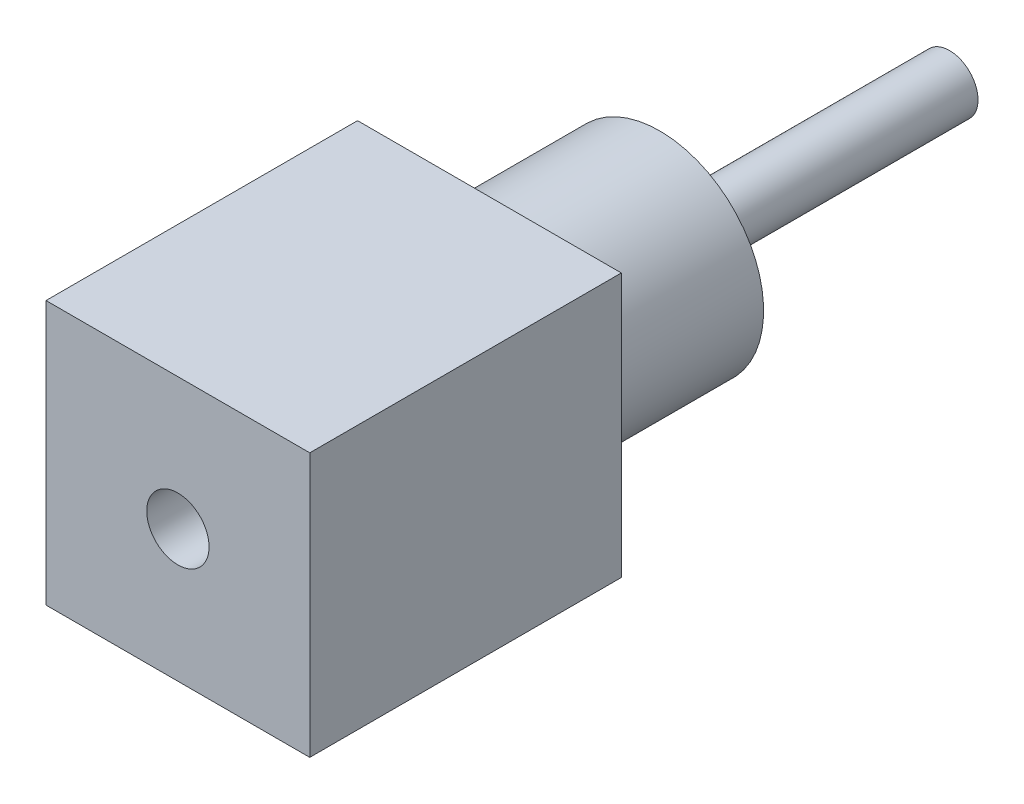
ISO-10303-21;
HEADER;
FILE_DESCRIPTION(('STEP AP214'),'2;1');
FILE_NAME('part.step','',(''),(''),'','','');
FILE_SCHEMA(('AUTOMOTIVE_DESIGN { 1 0 10303 214 1 1 1 1 }'));
ENDSEC;
DATA;
#1=APPLICATION_CONTEXT('core data for automotive mechanical design processes');
#2=APPLICATION_PROTOCOL_DEFINITION('international standard','automotive_design',2000,#1);
#3=PRODUCT_CONTEXT('',#1,'mechanical');
#4=PRODUCT('Part','Part','',(#3));
#5=PRODUCT_RELATED_PRODUCT_CATEGORY('part','',(#4));
#6=PRODUCT_DEFINITION_FORMATION('','',#4);
#7=PRODUCT_DEFINITION_CONTEXT('part definition',#1,'design');
#8=PRODUCT_DEFINITION('design','',#6,#7);
#9=PRODUCT_DEFINITION_SHAPE('','',#8);
#10=(LENGTH_UNIT() NAMED_UNIT(*) SI_UNIT(.MILLI.,.METRE.));
#11=(NAMED_UNIT(*) PLANE_ANGLE_UNIT() SI_UNIT($,.RADIAN.));
#12=(NAMED_UNIT(*) SI_UNIT($,.STERADIAN.) SOLID_ANGLE_UNIT());
#13=UNCERTAINTY_MEASURE_WITH_UNIT(LENGTH_MEASURE(1.E-05),#10,'distance_accuracy_value','');
#14=(GEOMETRIC_REPRESENTATION_CONTEXT(3) GLOBAL_UNCERTAINTY_ASSIGNED_CONTEXT((#13)) GLOBAL_UNIT_ASSIGNED_CONTEXT((#10,
#11,#12)) REPRESENTATION_CONTEXT('',''));
#15=CARTESIAN_POINT('',(0.,0.,0.));
#16=DIRECTION('',(0.,0.,1.));
#17=DIRECTION('',(1.,0.,0.));
#18=AXIS2_PLACEMENT_3D('',#15,#16,#17);
#19=CARTESIAN_POINT('',(-1.27,-1.27,3.));
#20=DIRECTION('',(1.,0.,0.));
#21=DIRECTION('',(0.,0.,-1.));
#22=AXIS2_PLACEMENT_3D('',#19,#20,#21);
#23=PLANE('',#22);
#24=DIRECTION('',(0.,-1.,0.));
#25=VECTOR('',#24,1.);
#26=CARTESIAN_POINT('',(-1.27,-1.27,0.));
#27=LINE('',#26,#25);
#28=CARTESIAN_POINT('',(-1.27,1.27,0.));
#29=VERTEX_POINT('',#28);
#30=CARTESIAN_POINT('',(-1.27,-1.27,0.));
#31=VERTEX_POINT('',#30);
#32=EDGE_CURVE('E100',#29,#31,#27,.T.);
#33=ORIENTED_EDGE('',*,*,#32,.T.);
#34=DIRECTION('',(0.,0.,-1.));
#35=VECTOR('',#34,1.);
#36=CARTESIAN_POINT('',(-1.27,-1.27,3.));
#37=LINE('',#36,#35);
#38=CARTESIAN_POINT('',(-1.27,-1.27,3.));
#39=VERTEX_POINT('',#38);
#40=EDGE_CURVE('E36',#39,#31,#37,.T.);
#41=ORIENTED_EDGE('',*,*,#40,.F.);
#42=DIRECTION('',(0.,-1.,0.));
#43=VECTOR('',#42,1.);
#44=CARTESIAN_POINT('',(-1.27,-1.27,3.));
#45=LINE('',#44,#43);
#46=CARTESIAN_POINT('',(-1.27,1.27,3.));
#47=VERTEX_POINT('',#46);
#48=EDGE_CURVE('E87',#47,#39,#45,.T.);
#49=ORIENTED_EDGE('',*,*,#48,.F.);
#50=DIRECTION('',(0.,0.,-1.));
#51=VECTOR('',#50,1.);
#52=CARTESIAN_POINT('',(-1.27,1.27,3.));
#53=LINE('',#52,#51);
#54=EDGE_CURVE('E96',#47,#29,#53,.T.);
#55=ORIENTED_EDGE('',*,*,#54,.T.);
#56=EDGE_LOOP('',(#33,#41,#49,#55));
#57=FACE_BOUND('',#56,.T.);
#58=ADVANCED_FACE('F33',(#57),#23,.F.);
#59=CARTESIAN_POINT('',(1.27,-1.27,3.));
#60=DIRECTION('',(0.,1.,0.));
#61=DIRECTION('',(-1.,0.,0.));
#62=AXIS2_PLACEMENT_3D('',#59,#60,#61);
#63=PLANE('',#62);
#64=DIRECTION('',(1.,0.,0.));
#65=VECTOR('',#64,1.);
#66=CARTESIAN_POINT('',(1.27,-1.27,0.));
#67=LINE('',#66,#65);
#68=CARTESIAN_POINT('',(1.27,-1.27,0.));
#69=VERTEX_POINT('',#68);
#70=EDGE_CURVE('E92',#31,#69,#67,.T.);
#71=ORIENTED_EDGE('',*,*,#70,.T.);
#72=DIRECTION('',(0.,0.,-1.));
#73=VECTOR('',#72,1.);
#74=CARTESIAN_POINT('',(1.27,-1.27,3.));
#75=LINE('',#74,#73);
#76=CARTESIAN_POINT('',(1.27,-1.27,3.));
#77=VERTEX_POINT('',#76);
#78=EDGE_CURVE('E90',#77,#69,#75,.T.);
#79=ORIENTED_EDGE('',*,*,#78,.F.);
#80=DIRECTION('',(1.,0.,0.));
#81=VECTOR('',#80,1.);
#82=CARTESIAN_POINT('',(1.27,-1.27,3.));
#83=LINE('',#82,#81);
#84=EDGE_CURVE('E82',#39,#77,#83,.T.);
#85=ORIENTED_EDGE('',*,*,#84,.F.);
#86=ORIENTED_EDGE('',*,*,#40,.T.);
#87=EDGE_LOOP('',(#71,#79,#85,#86));
#88=FACE_BOUND('',#87,.T.);
#89=ADVANCED_FACE('F91',(#88),#63,.F.);
#90=CARTESIAN_POINT('',(1.27,-1.27,3.));
#91=DIRECTION('',(-1.,0.,0.));
#92=DIRECTION('',(0.,0.,1.));
#93=AXIS2_PLACEMENT_3D('',#90,#91,#92);
#94=PLANE('',#93);
#95=DIRECTION('',(0.,1.,0.));
#96=VECTOR('',#95,1.);
#97=CARTESIAN_POINT('',(1.27,-1.27,0.));
#98=LINE('',#97,#96);
#99=CARTESIAN_POINT('',(1.27,1.27,0.));
#100=VERTEX_POINT('',#99);
#101=EDGE_CURVE('E68',#69,#100,#98,.T.);
#102=ORIENTED_EDGE('',*,*,#101,.T.);
#103=DIRECTION('',(0.,0.,-1.));
#104=VECTOR('',#103,1.);
#105=CARTESIAN_POINT('',(1.27,1.27,3.));
#106=LINE('',#105,#104);
#107=CARTESIAN_POINT('',(1.27,1.27,3.));
#108=VERTEX_POINT('',#107);
#109=EDGE_CURVE('E93',#108,#100,#106,.T.);
#110=ORIENTED_EDGE('',*,*,#109,.F.);
#111=DIRECTION('',(0.,1.,0.));
#112=VECTOR('',#111,1.);
#113=CARTESIAN_POINT('',(1.27,-1.27,3.));
#114=LINE('',#113,#112);
#115=EDGE_CURVE('E85',#77,#108,#114,.T.);
#116=ORIENTED_EDGE('',*,*,#115,.F.);
#117=ORIENTED_EDGE('',*,*,#78,.T.);
#118=EDGE_LOOP('',(#102,#110,#116,#117));
#119=FACE_BOUND('',#118,.T.);
#120=ADVANCED_FACE('F94',(#119),#94,.F.);
#121=CARTESIAN_POINT('',(1.27,1.27,3.));
#122=DIRECTION('',(0.,-1.,0.));
#123=DIRECTION('',(1.,0.,0.));
#124=AXIS2_PLACEMENT_3D('',#121,#122,#123);
#125=PLANE('',#124);
#126=DIRECTION('',(-1.,0.,0.));
#127=VECTOR('',#126,1.);
#128=CARTESIAN_POINT('',(1.27,1.27,0.));
#129=LINE('',#128,#127);
#130=EDGE_CURVE('E74',#100,#29,#129,.T.);
#131=ORIENTED_EDGE('',*,*,#130,.T.);
#132=ORIENTED_EDGE('',*,*,#54,.F.);
#133=DIRECTION('',(-1.,0.,0.));
#134=VECTOR('',#133,1.);
#135=CARTESIAN_POINT('',(1.27,1.27,3.));
#136=LINE('',#135,#134);
#137=EDGE_CURVE('E51',#108,#47,#136,.T.);
#138=ORIENTED_EDGE('',*,*,#137,.F.);
#139=ORIENTED_EDGE('',*,*,#109,.T.);
#140=EDGE_LOOP('',(#131,#132,#138,#139));
#141=FACE_BOUND('',#140,.T.);
#142=ADVANCED_FACE('F108',(#141),#125,.F.);
#143=CARTESIAN_POINT('',(0.,0.,3.));
#144=DIRECTION('',(0.,0.,1.));
#145=DIRECTION('',(1.,0.,0.));
#146=AXIS2_PLACEMENT_3D('',#143,#144,#145);
#147=PLANE('',#146);
#148=CARTESIAN_POINT('',(0.,0.,3.));
#149=DIRECTION('',(0.,0.,1.));
#150=DIRECTION('',(1.,0.,0.));
#151=AXIS2_PLACEMENT_3D('',#148,#149,#150);
#152=CIRCLE('',#151,0.3);
#153=CARTESIAN_POINT('',(0.3,0.,3.));
#154=VERTEX_POINT('',#153);
#155=EDGE_CURVE('E122',#154,#154,#152,.T.);
#156=ORIENTED_EDGE('',*,*,#155,.F.);
#157=EDGE_LOOP('',(#156));
#158=FACE_BOUND('',#157,.T.);
#159=ORIENTED_EDGE('',*,*,#48,.T.);
#160=ORIENTED_EDGE('',*,*,#84,.T.);
#161=ORIENTED_EDGE('',*,*,#115,.T.);
#162=ORIENTED_EDGE('',*,*,#137,.T.);
#163=EDGE_LOOP('',(#159,#160,#161,#162));
#164=FACE_BOUND('',#163,.T.);
#165=ADVANCED_FACE('F83',(#158,#164),#147,.T.);
#166=CARTESIAN_POINT('',(0.,0.,0.));
#167=DIRECTION('',(0.,0.,1.));
#168=DIRECTION('',(1.,0.,0.));
#169=AXIS2_PLACEMENT_3D('',#166,#167,#168);
#170=PLANE('',#169);
#171=CARTESIAN_POINT('',(0.,0.,0.));
#172=DIRECTION('',(0.,0.,-1.));
#173=DIRECTION('',(-1.,0.,0.));
#174=AXIS2_PLACEMENT_3D('',#171,#172,#173);
#175=CIRCLE('',#174,1.);
#176=CARTESIAN_POINT('',(-1.,0.,0.));
#177=VERTEX_POINT('',#176);
#178=EDGE_CURVE('E42',#177,#177,#175,.T.);
#179=ORIENTED_EDGE('',*,*,#178,.F.);
#180=EDGE_LOOP('',(#179));
#181=FACE_BOUND('',#180,.T.);
#182=ORIENTED_EDGE('',*,*,#32,.F.);
#183=ORIENTED_EDGE('',*,*,#130,.F.);
#184=ORIENTED_EDGE('',*,*,#101,.F.);
#185=ORIENTED_EDGE('',*,*,#70,.F.);
#186=EDGE_LOOP('',(#182,#183,#184,#185));
#187=FACE_BOUND('',#186,.T.);
#188=ADVANCED_FACE('F111',(#181,#187),#170,.F.);
#189=CARTESIAN_POINT('',(0.,0.,-1.64));
#190=DIRECTION('',(0.,0.,1.));
#191=DIRECTION('',(1.,0.,0.));
#192=AXIS2_PLACEMENT_3D('',#189,#190,#191);
#193=CYLINDRICAL_SURFACE('',#192,1.);
#194=CARTESIAN_POINT('',(0.,0.,-1.64));
#195=DIRECTION('',(0.,0.,-1.));
#196=DIRECTION('',(-1.,0.,0.));
#197=AXIS2_PLACEMENT_3D('',#194,#195,#196);
#198=CIRCLE('',#197,1.);
#199=CARTESIAN_POINT('',(-1.,0.,-1.64));
#200=VERTEX_POINT('',#199);
#201=EDGE_CURVE('E103',#200,#200,#198,.T.);
#202=ORIENTED_EDGE('',*,*,#201,.F.);
#203=EDGE_LOOP('',(#202));
#204=FACE_BOUND('',#203,.T.);
#205=ORIENTED_EDGE('',*,*,#178,.T.);
#206=EDGE_LOOP('',(#205));
#207=FACE_BOUND('',#206,.T.);
#208=ADVANCED_FACE('F143',(#204,#207),#193,.T.);
#209=CARTESIAN_POINT('',(0.,0.,-1.64));
#210=DIRECTION('',(0.,0.,-1.));
#211=DIRECTION('',(-1.,0.,0.));
#212=AXIS2_PLACEMENT_3D('',#209,#210,#211);
#213=PLANE('',#212);
#214=CARTESIAN_POINT('',(0.,0.,-1.64));
#215=DIRECTION('',(0.,0.,-1.));
#216=DIRECTION('',(-1.,0.,0.));
#217=AXIS2_PLACEMENT_3D('',#214,#215,#216);
#218=CIRCLE('',#217,0.275);
#219=CARTESIAN_POINT('',(-0.275,0.,-1.64));
#220=VERTEX_POINT('',#219);
#221=EDGE_CURVE('E11',#220,#220,#218,.T.);
#222=ORIENTED_EDGE('',*,*,#221,.F.);
#223=EDGE_LOOP('',(#222));
#224=FACE_BOUND('',#223,.T.);
#225=ORIENTED_EDGE('',*,*,#201,.T.);
#226=EDGE_LOOP('',(#225));
#227=FACE_BOUND('',#226,.T.);
#228=ADVANCED_FACE('F178',(#224,#227),#213,.T.);
#229=CARTESIAN_POINT('',(0.,0.,-4.43));
#230=DIRECTION('',(0.,0.,1.));
#231=DIRECTION('',(1.,0.,0.));
#232=AXIS2_PLACEMENT_3D('',#229,#230,#231);
#233=CYLINDRICAL_SURFACE('',#232,0.275);
#234=CARTESIAN_POINT('',(0.,0.,-4.43));
#235=DIRECTION('',(0.,0.,-1.));
#236=DIRECTION('',(-1.,0.,0.));
#237=AXIS2_PLACEMENT_3D('',#234,#235,#236);
#238=CIRCLE('',#237,0.275);
#239=CARTESIAN_POINT('',(-0.275,0.,-4.43));
#240=VERTEX_POINT('',#239);
#241=EDGE_CURVE('E117',#240,#240,#238,.T.);
#242=ORIENTED_EDGE('',*,*,#241,.F.);
#243=EDGE_LOOP('',(#242));
#244=FACE_BOUND('',#243,.T.);
#245=ORIENTED_EDGE('',*,*,#221,.T.);
#246=EDGE_LOOP('',(#245));
#247=FACE_BOUND('',#246,.T.);
#248=ADVANCED_FACE('F187',(#244,#247),#233,.T.);
#249=CARTESIAN_POINT('',(0.,0.,-4.43));
#250=DIRECTION('',(0.,0.,-1.));
#251=DIRECTION('',(-1.,0.,0.));
#252=AXIS2_PLACEMENT_3D('',#249,#250,#251);
#253=PLANE('',#252);
#254=ORIENTED_EDGE('',*,*,#241,.T.);
#255=EDGE_LOOP('',(#254));
#256=FACE_BOUND('',#255,.T.);
#257=ADVANCED_FACE('F133',(#256),#253,.T.);
#258=CARTESIAN_POINT('',(0.,0.,0.));
#259=DIRECTION('',(0.,0.,1.));
#260=DIRECTION('',(1.,0.,0.));
#261=AXIS2_PLACEMENT_3D('',#258,#259,#260);
#262=CYLINDRICAL_SURFACE('',#261,0.3);
#263=CARTESIAN_POINT('',(0.,0.,0.));
#264=DIRECTION('',(0.,0.,1.));
#265=DIRECTION('',(1.,0.,0.));
#266=AXIS2_PLACEMENT_3D('',#263,#264,#265);
#267=CIRCLE('',#266,0.3);
#268=CARTESIAN_POINT('',(0.3,0.,0.));
#269=VERTEX_POINT('',#268);
#270=EDGE_CURVE('E121',#269,#269,#267,.T.);
#271=ORIENTED_EDGE('',*,*,#270,.F.);
#272=EDGE_LOOP('',(#271));
#273=FACE_BOUND('',#272,.T.);
#274=ORIENTED_EDGE('',*,*,#155,.T.);
#275=EDGE_LOOP('',(#274));
#276=FACE_BOUND('',#275,.T.);
#277=ADVANCED_FACE('F130',(#273,#276),#262,.F.);
#278=CARTESIAN_POINT('',(0.,0.,0.));
#279=DIRECTION('',(0.,0.,1.));
#280=DIRECTION('',(1.,0.,0.));
#281=AXIS2_PLACEMENT_3D('',#278,#279,#280);
#282=PLANE('',#281);
#283=ORIENTED_EDGE('',*,*,#270,.T.);
#284=EDGE_LOOP('',(#283));
#285=FACE_BOUND('',#284,.T.);
#286=ADVANCED_FACE('F128',(#285),#282,.T.);
#287=CLOSED_SHELL('',(#58,#89,#120,#142,#165,#188,#208,#228,#248,#257,#277,#286));
#288=MANIFOLD_SOLID_BREP('B2',#287);
#289=ADVANCED_BREP_SHAPE_REPRESENTATION('',(#18,#288),#14);
#290=SHAPE_DEFINITION_REPRESENTATION(#9,#289);
ENDSEC;
END-ISO-10303-21;
